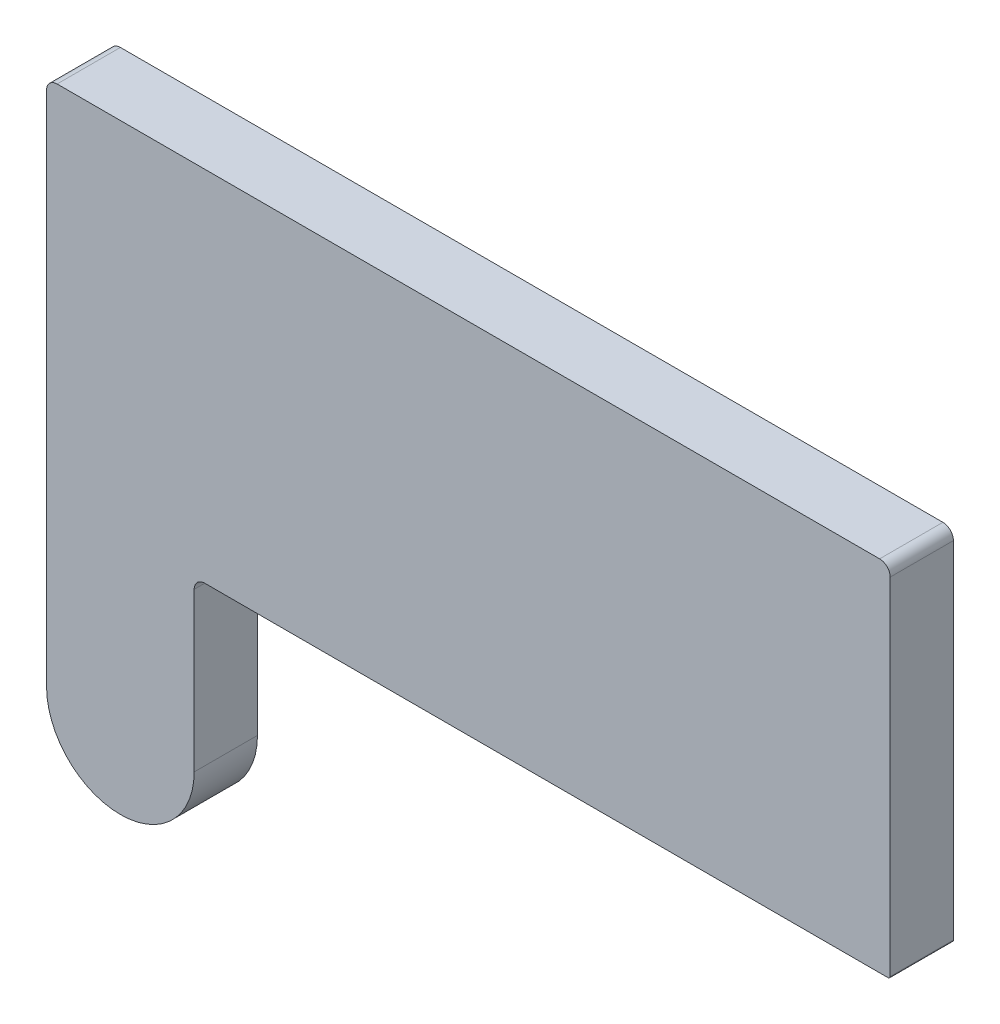
ISO-10303-21;
HEADER;
FILE_DESCRIPTION(('STEP AP214'),'2;1');
FILE_NAME('part.step','',(''),(''),'','','');
FILE_SCHEMA(('AUTOMOTIVE_DESIGN { 1 0 10303 214 1 1 1 1 }'));
ENDSEC;
DATA;
#1=APPLICATION_CONTEXT('core data for automotive mechanical design processes');
#2=APPLICATION_PROTOCOL_DEFINITION('international standard','automotive_design',2000,#1);
#3=PRODUCT_CONTEXT('',#1,'mechanical');
#4=PRODUCT('Part','Part','',(#3));
#5=PRODUCT_RELATED_PRODUCT_CATEGORY('part','',(#4));
#6=PRODUCT_DEFINITION_FORMATION('','',#4);
#7=PRODUCT_DEFINITION_CONTEXT('part definition',#1,'design');
#8=PRODUCT_DEFINITION('design','',#6,#7);
#9=PRODUCT_DEFINITION_SHAPE('','',#8);
#10=(LENGTH_UNIT() NAMED_UNIT(*) SI_UNIT(.MILLI.,.METRE.));
#11=(NAMED_UNIT(*) PLANE_ANGLE_UNIT() SI_UNIT($,.RADIAN.));
#12=(NAMED_UNIT(*) SI_UNIT($,.STERADIAN.) SOLID_ANGLE_UNIT());
#13=UNCERTAINTY_MEASURE_WITH_UNIT(LENGTH_MEASURE(1.E-05),#10,'distance_accuracy_value','');
#14=(GEOMETRIC_REPRESENTATION_CONTEXT(3) GLOBAL_UNCERTAINTY_ASSIGNED_CONTEXT((#13)) GLOBAL_UNIT_ASSIGNED_CONTEXT((#10,
#11,#12)) REPRESENTATION_CONTEXT('',''));
#15=CARTESIAN_POINT('',(0.,0.,0.));
#16=DIRECTION('',(0.,0.,1.));
#17=DIRECTION('',(1.,0.,0.));
#18=AXIS2_PLACEMENT_3D('',#15,#16,#17);
#19=CARTESIAN_POINT('',(3.5,0.,1.5));
#20=DIRECTION('',(0.,0.,-1.));
#21=DIRECTION('',(-1.,0.,0.));
#22=AXIS2_PLACEMENT_3D('',#19,#20,#21);
#23=CYLINDRICAL_SURFACE('',#22,3.5);
#24=CARTESIAN_POINT('',(3.5,0.,-1.5));
#25=DIRECTION('',(0.,0.,1.));
#26=DIRECTION('',(-1.,0.,0.));
#27=AXIS2_PLACEMENT_3D('',#24,#25,#26);
#28=CIRCLE('',#27,3.5);
#29=CARTESIAN_POINT('',(0.,0.,-1.5));
#30=VERTEX_POINT('',#29);
#31=CARTESIAN_POINT('',(7.,0.,-1.5));
#32=VERTEX_POINT('',#31);
#33=EDGE_CURVE('E140',#30,#32,#28,.T.);
#34=ORIENTED_EDGE('',*,*,#33,.T.);
#35=DIRECTION('',(0.,0.,-1.));
#36=VECTOR('',#35,1.);
#37=CARTESIAN_POINT('',(7.,0.,1.5));
#38=LINE('',#37,#36);
#39=CARTESIAN_POINT('',(7.,0.,1.5));
#40=VERTEX_POINT('',#39);
#41=EDGE_CURVE('E11',#40,#32,#38,.T.);
#42=ORIENTED_EDGE('',*,*,#41,.F.);
#43=CARTESIAN_POINT('',(3.5,0.,1.5));
#44=DIRECTION('',(0.,0.,1.));
#45=DIRECTION('',(-1.,0.,0.));
#46=AXIS2_PLACEMENT_3D('',#43,#44,#45);
#47=CIRCLE('',#46,3.5);
#48=CARTESIAN_POINT('',(0.,0.,1.5));
#49=VERTEX_POINT('',#48);
#50=EDGE_CURVE('E160',#49,#40,#47,.T.);
#51=ORIENTED_EDGE('',*,*,#50,.F.);
#52=DIRECTION('',(0.,0.,-1.));
#53=VECTOR('',#52,1.);
#54=CARTESIAN_POINT('',(0.,0.,1.5));
#55=LINE('',#54,#53);
#56=EDGE_CURVE('E136',#49,#30,#55,.T.);
#57=ORIENTED_EDGE('',*,*,#56,.T.);
#58=EDGE_LOOP('',(#34,#42,#51,#57));
#59=FACE_BOUND('',#58,.T.);
#60=ADVANCED_FACE('F33',(#59),#23,.T.);
#61=CARTESIAN_POINT('',(7.,7.5,1.5));
#62=DIRECTION('',(-1.,0.,0.));
#63=DIRECTION('',(0.,-1.,0.));
#64=AXIS2_PLACEMENT_3D('',#61,#62,#63);
#65=PLANE('',#64);
#66=DIRECTION('',(0.,1.,0.));
#67=VECTOR('',#66,1.);
#68=CARTESIAN_POINT('',(7.,7.5,-1.5));
#69=LINE('',#68,#67);
#70=CARTESIAN_POINT('',(7.,7.5,-1.5));
#71=VERTEX_POINT('',#70);
#72=EDGE_CURVE('E143',#32,#71,#69,.T.);
#73=ORIENTED_EDGE('',*,*,#72,.T.);
#74=DIRECTION('',(0.,0.,-1.));
#75=VECTOR('',#74,1.);
#76=CARTESIAN_POINT('',(7.,7.5,1.5));
#77=LINE('',#76,#75);
#78=CARTESIAN_POINT('',(7.,7.5,1.5));
#79=VERTEX_POINT('',#78);
#80=EDGE_CURVE('E41',#79,#71,#77,.T.);
#81=ORIENTED_EDGE('',*,*,#80,.F.);
#82=DIRECTION('',(0.,1.,0.));
#83=VECTOR('',#82,1.);
#84=CARTESIAN_POINT('',(7.,7.5,1.5));
#85=LINE('',#84,#83);
#86=EDGE_CURVE('E98',#40,#79,#85,.T.);
#87=ORIENTED_EDGE('',*,*,#86,.F.);
#88=ORIENTED_EDGE('',*,*,#41,.T.);
#89=EDGE_LOOP('',(#73,#81,#87,#88));
#90=FACE_BOUND('',#89,.T.);
#91=ADVANCED_FACE('F208',(#90),#65,.F.);
#92=CARTESIAN_POINT('',(7.5,7.5,1.5));
#93=DIRECTION('',(0.,0.,-1.));
#94=DIRECTION('',(-1.,0.,0.));
#95=AXIS2_PLACEMENT_3D('',#92,#93,#94);
#96=CYLINDRICAL_SURFACE('',#95,0.500000000000001);
#97=CARTESIAN_POINT('',(7.5,7.5,-1.5));
#98=DIRECTION('',(0.,0.,-1.));
#99=DIRECTION('',(1.,0.,0.));
#100=AXIS2_PLACEMENT_3D('',#97,#98,#99);
#101=CIRCLE('',#100,0.500000000000001);
#102=CARTESIAN_POINT('',(7.5,8.,-1.5));
#103=VERTEX_POINT('',#102);
#104=EDGE_CURVE('E145',#71,#103,#101,.T.);
#105=ORIENTED_EDGE('',*,*,#104,.T.);
#106=DIRECTION('',(0.,0.,-1.));
#107=VECTOR('',#106,1.);
#108=CARTESIAN_POINT('',(7.5,8.,1.5));
#109=LINE('',#108,#107);
#110=CARTESIAN_POINT('',(7.5,8.,1.5));
#111=VERTEX_POINT('',#110);
#112=EDGE_CURVE('E173',#111,#103,#109,.T.);
#113=ORIENTED_EDGE('',*,*,#112,.F.);
#114=CARTESIAN_POINT('',(7.5,7.5,1.5));
#115=DIRECTION('',(0.,0.,-1.));
#116=DIRECTION('',(1.,0.,0.));
#117=AXIS2_PLACEMENT_3D('',#114,#115,#116);
#118=CIRCLE('',#117,0.500000000000001);
#119=EDGE_CURVE('E181',#79,#111,#118,.T.);
#120=ORIENTED_EDGE('',*,*,#119,.F.);
#121=ORIENTED_EDGE('',*,*,#80,.T.);
#122=EDGE_LOOP('',(#105,#113,#120,#121));
#123=FACE_BOUND('',#122,.T.);
#124=ADVANCED_FACE('F179',(#123),#96,.F.);
#125=CARTESIAN_POINT('',(39.9,8.00000000000001,1.5));
#126=DIRECTION('',(0.,1.,0.));
#127=DIRECTION('',(-1.,0.,0.));
#128=AXIS2_PLACEMENT_3D('',#125,#126,#127);
#129=PLANE('',#128);
#130=DIRECTION('',(1.,0.,0.));
#131=VECTOR('',#130,1.);
#132=CARTESIAN_POINT('',(39.9,8.00000000000001,-1.5));
#133=LINE('',#132,#131);
#134=CARTESIAN_POINT('',(39.9,8.00000000000001,-1.5));
#135=VERTEX_POINT('',#134);
#136=EDGE_CURVE('E148',#103,#135,#133,.T.);
#137=ORIENTED_EDGE('',*,*,#136,.T.);
#138=DIRECTION('',(0.,0.,-1.));
#139=VECTOR('',#138,1.);
#140=CARTESIAN_POINT('',(39.9,8.00000000000001,1.5));
#141=LINE('',#140,#139);
#142=CARTESIAN_POINT('',(39.9,8.00000000000001,1.5));
#143=VERTEX_POINT('',#142);
#144=EDGE_CURVE('E170',#143,#135,#141,.T.);
#145=ORIENTED_EDGE('',*,*,#144,.F.);
#146=DIRECTION('',(1.,0.,0.));
#147=VECTOR('',#146,1.);
#148=CARTESIAN_POINT('',(36.9669249219146,8.00000000000001,1.5));
#149=LINE('',#148,#147);
#150=EDGE_CURVE('E198',#111,#143,#149,.T.);
#151=ORIENTED_EDGE('',*,*,#150,.F.);
#152=ORIENTED_EDGE('',*,*,#112,.T.);
#153=EDGE_LOOP('',(#137,#145,#151,#152));
#154=FACE_BOUND('',#153,.T.);
#155=ADVANCED_FACE('F189',(#154),#129,.F.);
#156=CARTESIAN_POINT('',(39.9,8.10000000000001,1.5));
#157=DIRECTION('',(0.,0.,-1.));
#158=DIRECTION('',(-1.,0.,0.));
#159=AXIS2_PLACEMENT_3D('',#156,#157,#158);
#160=CYLINDRICAL_SURFACE('',#159,0.0999999999999951);
#161=CARTESIAN_POINT('',(39.9,8.10000000000001,-1.5));
#162=DIRECTION('',(0.,0.,1.));
#163=DIRECTION('',(-1.,0.,0.));
#164=AXIS2_PLACEMENT_3D('',#161,#162,#163);
#165=CIRCLE('',#164,0.0999999999999951);
#166=CARTESIAN_POINT('',(40.,8.10000000000001,-1.5));
#167=VERTEX_POINT('',#166);
#168=EDGE_CURVE('E150',#135,#167,#165,.T.);
#169=ORIENTED_EDGE('',*,*,#168,.T.);
#170=DIRECTION('',(0.,0.,-1.));
#171=VECTOR('',#170,1.);
#172=CARTESIAN_POINT('',(40.,8.10000000000001,1.5));
#173=LINE('',#172,#171);
#174=CARTESIAN_POINT('',(40.,8.10000000000001,1.5));
#175=VERTEX_POINT('',#174);
#176=EDGE_CURVE('E167',#175,#167,#173,.T.);
#177=ORIENTED_EDGE('',*,*,#176,.F.);
#178=CARTESIAN_POINT('',(39.9,8.10000000000001,1.5));
#179=DIRECTION('',(0.,0.,1.));
#180=DIRECTION('',(-1.,0.,0.));
#181=AXIS2_PLACEMENT_3D('',#178,#179,#180);
#182=CIRCLE('',#181,0.0999999999999951);
#183=EDGE_CURVE('E195',#143,#175,#182,.T.);
#184=ORIENTED_EDGE('',*,*,#183,.F.);
#185=ORIENTED_EDGE('',*,*,#144,.T.);
#186=EDGE_LOOP('',(#169,#177,#184,#185));
#187=FACE_BOUND('',#186,.T.);
#188=ADVANCED_FACE('F193',(#187),#160,.T.);
#189=CARTESIAN_POINT('',(40.,24.5,1.5));
#190=DIRECTION('',(-1.,0.,0.));
#191=DIRECTION('',(0.,0.,1.));
#192=AXIS2_PLACEMENT_3D('',#189,#190,#191);
#193=PLANE('',#192);
#194=DIRECTION('',(0.,1.,0.));
#195=VECTOR('',#194,1.);
#196=CARTESIAN_POINT('',(40.,24.5,-1.5));
#197=LINE('',#196,#195);
#198=CARTESIAN_POINT('',(40.,24.5,-1.5));
#199=VERTEX_POINT('',#198);
#200=EDGE_CURVE('E152',#167,#199,#197,.T.);
#201=ORIENTED_EDGE('',*,*,#200,.T.);
#202=DIRECTION('',(0.,0.,-1.));
#203=VECTOR('',#202,1.);
#204=CARTESIAN_POINT('',(40.,24.5,1.5));
#205=LINE('',#204,#203);
#206=CARTESIAN_POINT('',(40.,24.5,1.5));
#207=VERTEX_POINT('',#206);
#208=EDGE_CURVE('E164',#207,#199,#205,.T.);
#209=ORIENTED_EDGE('',*,*,#208,.F.);
#210=DIRECTION('',(0.,1.,0.));
#211=VECTOR('',#210,1.);
#212=CARTESIAN_POINT('',(40.,24.5,1.5));
#213=LINE('',#212,#211);
#214=EDGE_CURVE('E197',#175,#207,#213,.T.);
#215=ORIENTED_EDGE('',*,*,#214,.F.);
#216=ORIENTED_EDGE('',*,*,#176,.T.);
#217=EDGE_LOOP('',(#201,#209,#215,#216));
#218=FACE_BOUND('',#217,.T.);
#219=ADVANCED_FACE('F220',(#218),#193,.F.);
#220=CARTESIAN_POINT('',(39.5,24.5,1.5));
#221=DIRECTION('',(0.,0.,-1.));
#222=DIRECTION('',(-1.,0.,0.));
#223=AXIS2_PLACEMENT_3D('',#220,#221,#222);
#224=CYLINDRICAL_SURFACE('',#223,0.500000000000002);
#225=CARTESIAN_POINT('',(39.5,24.5,-1.5));
#226=DIRECTION('',(0.,0.,1.));
#227=DIRECTION('',(-1.,0.,0.));
#228=AXIS2_PLACEMENT_3D('',#225,#226,#227);
#229=CIRCLE('',#228,0.500000000000002);
#230=CARTESIAN_POINT('',(39.5,25.,-1.5));
#231=VERTEX_POINT('',#230);
#232=EDGE_CURVE('E154',#199,#231,#229,.T.);
#233=ORIENTED_EDGE('',*,*,#232,.T.);
#234=DIRECTION('',(0.,0.,-1.));
#235=VECTOR('',#234,1.);
#236=CARTESIAN_POINT('',(39.5,25.,1.5));
#237=LINE('',#236,#235);
#238=CARTESIAN_POINT('',(39.5,25.,1.5));
#239=VERTEX_POINT('',#238);
#240=EDGE_CURVE('E131',#239,#231,#237,.T.);
#241=ORIENTED_EDGE('',*,*,#240,.F.);
#242=CARTESIAN_POINT('',(39.5,24.5,1.5));
#243=DIRECTION('',(0.,0.,1.));
#244=DIRECTION('',(-1.,0.,0.));
#245=AXIS2_PLACEMENT_3D('',#242,#243,#244);
#246=CIRCLE('',#245,0.500000000000002);
#247=EDGE_CURVE('E123',#207,#239,#246,.T.);
#248=ORIENTED_EDGE('',*,*,#247,.F.);
#249=ORIENTED_EDGE('',*,*,#208,.T.);
#250=EDGE_LOOP('',(#233,#241,#248,#249));
#251=FACE_BOUND('',#250,.T.);
#252=ADVANCED_FACE('F223',(#251),#224,.T.);
#253=CARTESIAN_POINT('',(0.499999999999994,25.,1.5));
#254=DIRECTION('',(0.,-1.,0.));
#255=DIRECTION('',(1.,0.,0.));
#256=AXIS2_PLACEMENT_3D('',#253,#254,#255);
#257=PLANE('',#256);
#258=DIRECTION('',(-1.,0.,0.));
#259=VECTOR('',#258,1.);
#260=CARTESIAN_POINT('',(0.499999999999994,25.,-1.5));
#261=LINE('',#260,#259);
#262=CARTESIAN_POINT('',(0.499999999999994,25.,-1.5));
#263=VERTEX_POINT('',#262);
#264=EDGE_CURVE('E130',#231,#263,#261,.T.);
#265=ORIENTED_EDGE('',*,*,#264,.T.);
#266=DIRECTION('',(0.,0.,-1.));
#267=VECTOR('',#266,1.);
#268=CARTESIAN_POINT('',(0.499999999999994,25.,1.5));
#269=LINE('',#268,#267);
#270=CARTESIAN_POINT('',(0.499999999999994,25.,1.5));
#271=VERTEX_POINT('',#270);
#272=EDGE_CURVE('E128',#271,#263,#269,.T.);
#273=ORIENTED_EDGE('',*,*,#272,.F.);
#274=DIRECTION('',(-1.,0.,0.));
#275=VECTOR('',#274,1.);
#276=CARTESIAN_POINT('',(28.3397459621556,25.,1.5));
#277=LINE('',#276,#275);
#278=EDGE_CURVE('E117',#239,#271,#277,.T.);
#279=ORIENTED_EDGE('',*,*,#278,.F.);
#280=ORIENTED_EDGE('',*,*,#240,.T.);
#281=EDGE_LOOP('',(#265,#273,#279,#280));
#282=FACE_BOUND('',#281,.T.);
#283=ADVANCED_FACE('F129',(#282),#257,.F.);
#284=CARTESIAN_POINT('',(0.499999999999994,24.5,1.5));
#285=DIRECTION('',(0.,0.,-1.));
#286=DIRECTION('',(-1.,0.,0.));
#287=AXIS2_PLACEMENT_3D('',#284,#285,#286);
#288=CYLINDRICAL_SURFACE('',#287,0.499999999999999);
#289=CARTESIAN_POINT('',(0.499999999999994,24.5,-1.5));
#290=DIRECTION('',(0.,0.,1.));
#291=DIRECTION('',(-1.,0.,0.));
#292=AXIS2_PLACEMENT_3D('',#289,#290,#291);
#293=CIRCLE('',#292,0.499999999999999);
#294=CARTESIAN_POINT('',(0.,24.5,-1.5));
#295=VERTEX_POINT('',#294);
#296=EDGE_CURVE('E84',#263,#295,#293,.T.);
#297=ORIENTED_EDGE('',*,*,#296,.T.);
#298=DIRECTION('',(0.,0.,-1.));
#299=VECTOR('',#298,1.);
#300=CARTESIAN_POINT('',(0.,24.5,1.5));
#301=LINE('',#300,#299);
#302=CARTESIAN_POINT('',(0.,24.5,1.5));
#303=VERTEX_POINT('',#302);
#304=EDGE_CURVE('E132',#303,#295,#301,.T.);
#305=ORIENTED_EDGE('',*,*,#304,.F.);
#306=CARTESIAN_POINT('',(0.499999999999994,24.5,1.5));
#307=DIRECTION('',(0.,0.,1.));
#308=DIRECTION('',(-1.,0.,0.));
#309=AXIS2_PLACEMENT_3D('',#306,#307,#308);
#310=CIRCLE('',#309,0.499999999999999);
#311=EDGE_CURVE('E121',#271,#303,#310,.T.);
#312=ORIENTED_EDGE('',*,*,#311,.F.);
#313=ORIENTED_EDGE('',*,*,#272,.T.);
#314=EDGE_LOOP('',(#297,#305,#312,#313));
#315=FACE_BOUND('',#314,.T.);
#316=ADVANCED_FACE('F134',(#315),#288,.T.);
#317=CARTESIAN_POINT('',(0.,0.,1.5));
#318=DIRECTION('',(1.,0.,0.));
#319=DIRECTION('',(0.,1.,0.));
#320=AXIS2_PLACEMENT_3D('',#317,#318,#319);
#321=PLANE('',#320);
#322=DIRECTION('',(0.,-1.,0.));
#323=VECTOR('',#322,1.);
#324=CARTESIAN_POINT('',(0.,0.,-1.5));
#325=LINE('',#324,#323);
#326=EDGE_CURVE('E90',#295,#30,#325,.T.);
#327=ORIENTED_EDGE('',*,*,#326,.T.);
#328=ORIENTED_EDGE('',*,*,#56,.F.);
#329=DIRECTION('',(0.,-1.,0.));
#330=VECTOR('',#329,1.);
#331=CARTESIAN_POINT('',(0.,0.,1.5));
#332=LINE('',#331,#330);
#333=EDGE_CURVE('E49',#303,#49,#332,.T.);
#334=ORIENTED_EDGE('',*,*,#333,.F.);
#335=ORIENTED_EDGE('',*,*,#304,.T.);
#336=EDGE_LOOP('',(#327,#328,#334,#335));
#337=FACE_BOUND('',#336,.T.);
#338=ADVANCED_FACE('F232',(#337),#321,.F.);
#339=CARTESIAN_POINT('',(3.5,0.,1.5));
#340=DIRECTION('',(0.,0.,-1.));
#341=DIRECTION('',(-1.,0.,0.));
#342=AXIS2_PLACEMENT_3D('',#339,#340,#341);
#343=PLANE('',#342);
#344=ORIENTED_EDGE('',*,*,#50,.T.);
#345=ORIENTED_EDGE('',*,*,#86,.T.);
#346=ORIENTED_EDGE('',*,*,#119,.T.);
#347=ORIENTED_EDGE('',*,*,#150,.T.);
#348=ORIENTED_EDGE('',*,*,#183,.T.);
#349=ORIENTED_EDGE('',*,*,#214,.T.);
#350=ORIENTED_EDGE('',*,*,#247,.T.);
#351=ORIENTED_EDGE('',*,*,#278,.T.);
#352=ORIENTED_EDGE('',*,*,#311,.T.);
#353=ORIENTED_EDGE('',*,*,#333,.T.);
#354=EDGE_LOOP('',(#344,#345,#346,#347,#348,#349,#350,#351,#352,#353));
#355=FACE_BOUND('',#354,.T.);
#356=ADVANCED_FACE('F119',(#355),#343,.F.);
#357=CARTESIAN_POINT('',(3.5,0.,-1.5));
#358=DIRECTION('',(0.,0.,-1.));
#359=DIRECTION('',(-1.,0.,0.));
#360=AXIS2_PLACEMENT_3D('',#357,#358,#359);
#361=PLANE('',#360);
#362=ORIENTED_EDGE('',*,*,#33,.F.);
#363=ORIENTED_EDGE('',*,*,#326,.F.);
#364=ORIENTED_EDGE('',*,*,#296,.F.);
#365=ORIENTED_EDGE('',*,*,#264,.F.);
#366=ORIENTED_EDGE('',*,*,#232,.F.);
#367=ORIENTED_EDGE('',*,*,#200,.F.);
#368=ORIENTED_EDGE('',*,*,#168,.F.);
#369=ORIENTED_EDGE('',*,*,#136,.F.);
#370=ORIENTED_EDGE('',*,*,#104,.F.);
#371=ORIENTED_EDGE('',*,*,#72,.F.);
#372=EDGE_LOOP('',(#362,#363,#364,#365,#366,#367,#368,#369,#370,#371));
#373=FACE_BOUND('',#372,.T.);
#374=ADVANCED_FACE('F184',(#373),#361,.T.);
#375=CLOSED_SHELL('',(#60,#91,#124,#155,#188,#219,#252,#283,#316,#338,#356,#374));
#376=MANIFOLD_SOLID_BREP('B2',#375);
#377=ADVANCED_BREP_SHAPE_REPRESENTATION('',(#18,#376),#14);
#378=SHAPE_DEFINITION_REPRESENTATION(#9,#377);
ENDSEC;
END-ISO-10303-21;
